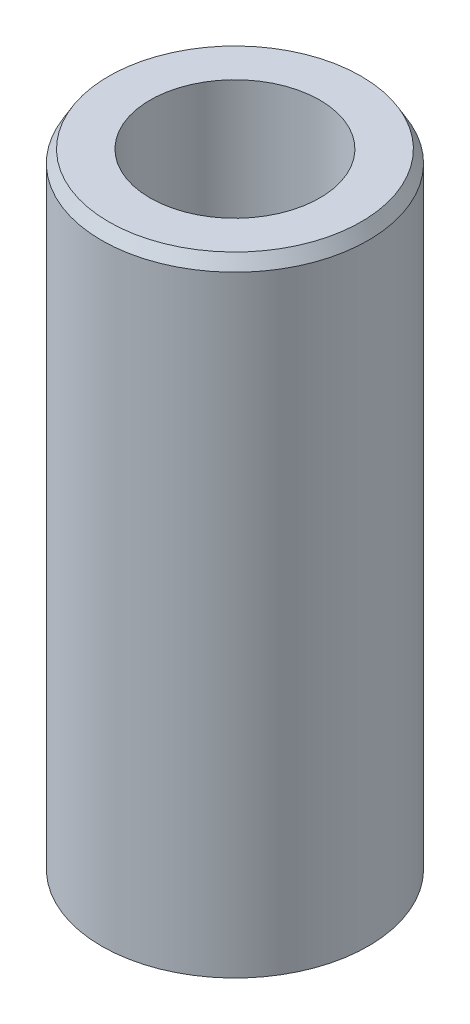
ISO-10303-21;
HEADER;
FILE_DESCRIPTION(('STEP AP214'),'2;1');
FILE_NAME('part.step','',(''),(''),'','','');
FILE_SCHEMA(('AUTOMOTIVE_DESIGN { 1 0 10303 214 1 1 1 1 }'));
ENDSEC;
DATA;
#1=APPLICATION_CONTEXT('core data for automotive mechanical design processes');
#2=APPLICATION_PROTOCOL_DEFINITION('international standard','automotive_design',2000,#1);
#3=PRODUCT_CONTEXT('',#1,'mechanical');
#4=PRODUCT('Part','Part','',(#3));
#5=PRODUCT_RELATED_PRODUCT_CATEGORY('part','',(#4));
#6=PRODUCT_DEFINITION_FORMATION('','',#4);
#7=PRODUCT_DEFINITION_CONTEXT('part definition',#1,'design');
#8=PRODUCT_DEFINITION('design','',#6,#7);
#9=PRODUCT_DEFINITION_SHAPE('','',#8);
#10=(LENGTH_UNIT() NAMED_UNIT(*) SI_UNIT(.MILLI.,.METRE.));
#11=(NAMED_UNIT(*) PLANE_ANGLE_UNIT() SI_UNIT($,.RADIAN.));
#12=(NAMED_UNIT(*) SI_UNIT($,.STERADIAN.) SOLID_ANGLE_UNIT());
#13=UNCERTAINTY_MEASURE_WITH_UNIT(LENGTH_MEASURE(1.E-05),#10,'distance_accuracy_value','');
#14=(GEOMETRIC_REPRESENTATION_CONTEXT(3) GLOBAL_UNCERTAINTY_ASSIGNED_CONTEXT((#13)) GLOBAL_UNIT_ASSIGNED_CONTEXT((#10,
#11,#12)) REPRESENTATION_CONTEXT('',''));
#15=CARTESIAN_POINT('',(0.,0.,0.));
#16=DIRECTION('',(0.,0.,1.));
#17=DIRECTION('',(1.,0.,0.));
#18=AXIS2_PLACEMENT_3D('',#15,#16,#17);
#19=CARTESIAN_POINT('',(0.,141.901696831622,0.));
#20=DIRECTION('',(0.,-1.,0.));
#21=DIRECTION('',(0.,0.,-1.));
#22=AXIS2_PLACEMENT_3D('',#19,#20,#21);
#23=CYLINDRICAL_SURFACE('',#22,30.);
#24=CARTESIAN_POINT('',(0.,139.105406021388,0.));
#25=DIRECTION('',(0.,1.,0.));
#26=DIRECTION('',(0.,0.,1.));
#27=AXIS2_PLACEMENT_3D('',#24,#25,#26);
#28=CIRCLE('',#27,30.);
#29=CARTESIAN_POINT('',(0.,139.105406021388,30.));
#30=VERTEX_POINT('',#29);
#31=EDGE_CURVE('E50',#30,#30,#28,.F.);
#32=ORIENTED_EDGE('',*,*,#31,.T.);
#33=EDGE_LOOP('',(#32));
#34=FACE_BOUND('',#33,.T.);
#35=CARTESIAN_POINT('',(0.,1.61443925202118,0.));
#36=DIRECTION('',(0.,1.,0.));
#37=DIRECTION('',(0.,0.,1.));
#38=AXIS2_PLACEMENT_3D('',#35,#36,#37);
#39=CIRCLE('',#38,30.);
#40=CARTESIAN_POINT('',(0.,1.61443925202118,30.));
#41=VERTEX_POINT('',#40);
#42=EDGE_CURVE('E51',#41,#41,#39,.T.);
#43=ORIENTED_EDGE('',*,*,#42,.T.);
#44=EDGE_LOOP('',(#43));
#45=FACE_BOUND('',#44,.T.);
#46=ADVANCED_FACE('F39',(#34,#45),#23,.T.);
#47=CARTESIAN_POINT('',(0.,141.901696831622,0.));
#48=DIRECTION('',(0.,1.,0.));
#49=DIRECTION('',(0.,0.,1.));
#50=AXIS2_PLACEMENT_3D('',#47,#48,#49);
#51=PLANE('',#50);
#52=CARTESIAN_POINT('',(0.,141.901696831622,0.));
#53=DIRECTION('',(0.,1.,0.));
#54=DIRECTION('',(0.,0.,1.));
#55=AXIS2_PLACEMENT_3D('',#52,#53,#54);
#56=CIRCLE('',#55,28.3855607479788);
#57=CARTESIAN_POINT('',(0.,141.901696831622,28.3855607479788));
#58=VERTEX_POINT('',#57);
#59=EDGE_CURVE('E54',#58,#58,#56,.T.);
#60=ORIENTED_EDGE('',*,*,#59,.T.);
#61=EDGE_LOOP('',(#60));
#62=FACE_BOUND('',#61,.T.);
#63=CARTESIAN_POINT('',(0.,141.901696831622,0.));
#64=DIRECTION('',(0.,1.,0.));
#65=DIRECTION('',(0.,0.,1.));
#66=AXIS2_PLACEMENT_3D('',#63,#64,#65);
#67=CIRCLE('',#66,19.0892720412553);
#68=CARTESIAN_POINT('',(0.,141.901696831622,19.0892720412553));
#69=VERTEX_POINT('',#68);
#70=EDGE_CURVE('E58',#69,#69,#67,.T.);
#71=ORIENTED_EDGE('',*,*,#70,.F.);
#72=EDGE_LOOP('',(#71));
#73=FACE_BOUND('',#72,.T.);
#74=ADVANCED_FACE('F69',(#62,#73),#51,.T.);
#75=CARTESIAN_POINT('',(0.,0.,0.));
#76=DIRECTION('',(0.,1.,0.));
#77=DIRECTION('',(0.,0.,1.));
#78=AXIS2_PLACEMENT_3D('',#75,#76,#77);
#79=PLANE('',#78);
#80=CARTESIAN_POINT('',(0.,0.,0.));
#81=DIRECTION('',(0.,1.,0.));
#82=DIRECTION('',(0.,0.,1.));
#83=AXIS2_PLACEMENT_3D('',#80,#81,#82);
#84=CIRCLE('',#83,27.2037091897658);
#85=CARTESIAN_POINT('',(0.,0.,27.2037091897658));
#86=VERTEX_POINT('',#85);
#87=EDGE_CURVE('E10',#86,#86,#84,.F.);
#88=ORIENTED_EDGE('',*,*,#87,.T.);
#89=EDGE_LOOP('',(#88));
#90=FACE_BOUND('',#89,.T.);
#91=CARTESIAN_POINT('',(0.,0.,0.));
#92=DIRECTION('',(0.,1.,0.));
#93=DIRECTION('',(0.,0.,1.));
#94=AXIS2_PLACEMENT_3D('',#91,#92,#93);
#95=CIRCLE('',#94,19.0892720412553);
#96=CARTESIAN_POINT('',(0.,0.,19.0892720412553));
#97=VERTEX_POINT('',#96);
#98=EDGE_CURVE('E63',#97,#97,#95,.T.);
#99=ORIENTED_EDGE('',*,*,#98,.T.);
#100=EDGE_LOOP('',(#99));
#101=FACE_BOUND('',#100,.T.);
#102=ADVANCED_FACE('F75',(#90,#101),#79,.F.);
#103=CARTESIAN_POINT('',(0.,141.901696831622,0.));
#104=DIRECTION('',(0.,-1.,0.));
#105=DIRECTION('',(0.,0.,-1.));
#106=AXIS2_PLACEMENT_3D('',#103,#104,#105);
#107=CYLINDRICAL_SURFACE('',#106,19.0892720412553);
#108=ORIENTED_EDGE('',*,*,#70,.T.);
#109=EDGE_LOOP('',(#108));
#110=FACE_BOUND('',#109,.T.);
#111=ORIENTED_EDGE('',*,*,#98,.F.);
#112=EDGE_LOOP('',(#111));
#113=FACE_BOUND('',#112,.T.);
#114=ADVANCED_FACE('F70',(#110,#113),#107,.F.);
#115=CARTESIAN_POINT('',(0.,141.901696831622,0.));
#116=DIRECTION('',(0.,-1.,0.));
#117=DIRECTION('',(0.,0.,-1.));
#118=AXIS2_PLACEMENT_3D('',#115,#116,#117);
#119=CONICAL_SURFACE('',#118,28.3855607479788,0.523598775598292);
#120=ORIENTED_EDGE('',*,*,#31,.F.);
#121=EDGE_LOOP('',(#120));
#122=FACE_BOUND('',#121,.T.);
#123=ORIENTED_EDGE('',*,*,#59,.F.);
#124=EDGE_LOOP('',(#123));
#125=FACE_BOUND('',#124,.T.);
#126=ADVANCED_FACE('F81',(#122,#125),#119,.T.);
#127=CARTESIAN_POINT('',(0.,1.61443925202118,0.));
#128=DIRECTION('',(0.,1.,0.));
#129=DIRECTION('',(0.,0.,1.));
#130=AXIS2_PLACEMENT_3D('',#127,#128,#129);
#131=CONICAL_SURFACE('',#130,30.,1.0471975511966);
#132=ORIENTED_EDGE('',*,*,#87,.F.);
#133=EDGE_LOOP('',(#132));
#134=FACE_BOUND('',#133,.T.);
#135=ORIENTED_EDGE('',*,*,#42,.F.);
#136=EDGE_LOOP('',(#135));
#137=FACE_BOUND('',#136,.T.);
#138=ADVANCED_FACE('F45',(#134,#137),#131,.T.);
#139=CLOSED_SHELL('',(#46,#74,#102,#114,#126,#138));
#140=MANIFOLD_SOLID_BREP('B2',#139);
#141=ADVANCED_BREP_SHAPE_REPRESENTATION('',(#18,#140),#14);
#142=SHAPE_DEFINITION_REPRESENTATION(#9,#141);
ENDSEC;
END-ISO-10303-21;
